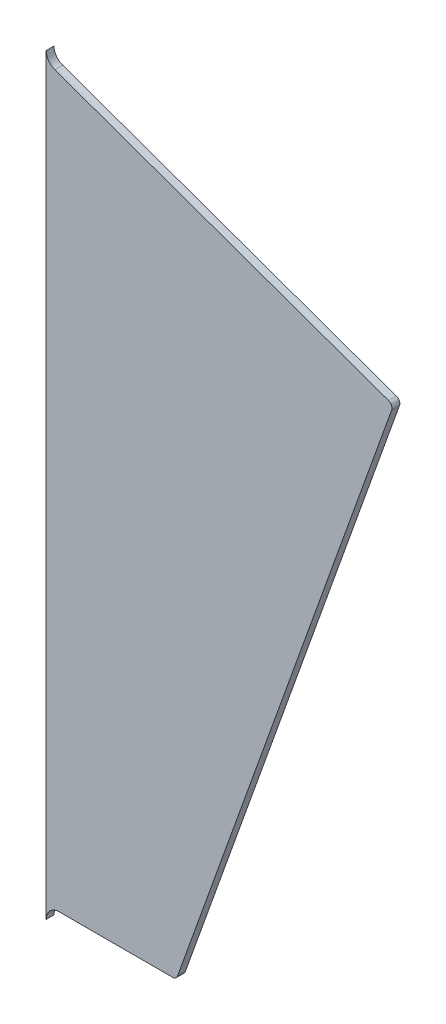
ISO-10303-21;
HEADER;
FILE_DESCRIPTION(('STEP AP214'),'2;1');
FILE_NAME('part.step','',(''),(''),'','','');
FILE_SCHEMA(('AUTOMOTIVE_DESIGN { 1 0 10303 214 1 1 1 1 }'));
ENDSEC;
DATA;
#1=APPLICATION_CONTEXT('core data for automotive mechanical design processes');
#2=APPLICATION_PROTOCOL_DEFINITION('international standard','automotive_design',2000,#1);
#3=PRODUCT_CONTEXT('',#1,'mechanical');
#4=PRODUCT('Part','Part','',(#3));
#5=PRODUCT_RELATED_PRODUCT_CATEGORY('part','',(#4));
#6=PRODUCT_DEFINITION_FORMATION('','',#4);
#7=PRODUCT_DEFINITION_CONTEXT('part definition',#1,'design');
#8=PRODUCT_DEFINITION('design','',#6,#7);
#9=PRODUCT_DEFINITION_SHAPE('','',#8);
#10=(LENGTH_UNIT() NAMED_UNIT(*) SI_UNIT(.MILLI.,.METRE.));
#11=(NAMED_UNIT(*) PLANE_ANGLE_UNIT() SI_UNIT($,.RADIAN.));
#12=(NAMED_UNIT(*) SI_UNIT($,.STERADIAN.) SOLID_ANGLE_UNIT());
#13=UNCERTAINTY_MEASURE_WITH_UNIT(LENGTH_MEASURE(1.E-05),#10,'distance_accuracy_value','');
#14=(GEOMETRIC_REPRESENTATION_CONTEXT(3) GLOBAL_UNCERTAINTY_ASSIGNED_CONTEXT((#13)) GLOBAL_UNIT_ASSIGNED_CONTEXT((#10,
#11,#12)) REPRESENTATION_CONTEXT('',''));
#15=CARTESIAN_POINT('',(0.,0.,0.));
#16=DIRECTION('',(0.,0.,1.));
#17=DIRECTION('',(1.,0.,0.));
#18=AXIS2_PLACEMENT_3D('',#15,#16,#17);
#19=CARTESIAN_POINT('',(3.99999999999998,3.34627629908769,-1.5));
#20=DIRECTION('',(0.,0.,1.));
#21=DIRECTION('',(1.,0.,0.));
#22=AXIS2_PLACEMENT_3D('',#19,#20,#21);
#23=CYLINDRICAL_SURFACE('',#22,2.50000000000001);
#24=CARTESIAN_POINT('',(3.99999999999998,3.34627629908769,0.));
#25=DIRECTION('',(0.,0.,-1.));
#26=DIRECTION('',(1.,0.,0.));
#27=AXIS2_PLACEMENT_3D('',#24,#25,#26);
#28=CIRCLE('',#27,2.50000000000001);
#29=CARTESIAN_POINT('',(3.15619224022895,0.992983188455233,0.));
#30=VERTEX_POINT('',#29);
#31=CARTESIAN_POINT('',(1.49999999999997,3.34627629908769,0.));
#32=VERTEX_POINT('',#31);
#33=EDGE_CURVE('E135',#30,#32,#28,.T.);
#34=ORIENTED_EDGE('',*,*,#33,.F.);
#35=DIRECTION('',(0.,0.,1.));
#36=VECTOR('',#35,1.);
#37=CARTESIAN_POINT('',(3.15619224022895,0.992983188455233,-1.5));
#38=LINE('',#37,#36);
#39=CARTESIAN_POINT('',(3.15619224022895,0.992983188455233,-1.5));
#40=VERTEX_POINT('',#39);
#41=EDGE_CURVE('E11',#40,#30,#38,.T.);
#42=ORIENTED_EDGE('',*,*,#41,.F.);
#43=CARTESIAN_POINT('',(3.99999999999998,3.34627629908769,-1.5));
#44=DIRECTION('',(0.,0.,-1.));
#45=DIRECTION('',(1.,0.,0.));
#46=AXIS2_PLACEMENT_3D('',#43,#44,#45);
#47=CIRCLE('',#46,2.50000000000001);
#48=CARTESIAN_POINT('',(1.49999999999997,3.34627629908769,-1.5));
#49=VERTEX_POINT('',#48);
#50=EDGE_CURVE('E155',#40,#49,#47,.T.);
#51=ORIENTED_EDGE('',*,*,#50,.T.);
#52=DIRECTION('',(0.,0.,1.));
#53=VECTOR('',#52,1.);
#54=CARTESIAN_POINT('',(1.49999999999997,3.34627629908769,-1.5));
#55=LINE('',#54,#53);
#56=EDGE_CURVE('E41',#49,#32,#55,.T.);
#57=ORIENTED_EDGE('',*,*,#56,.T.);
#58=EDGE_LOOP('',(#34,#42,#51,#57));
#59=FACE_BOUND('',#58,.T.);
#60=ADVANCED_FACE('F38',(#59),#23,.F.);
#61=CARTESIAN_POINT('',(67.1520670274041,-21.9536763223277,-1.5));
#62=DIRECTION('',(0.337523103908415,0.941317244252982,0.));
#63=DIRECTION('',(-0.941317244252983,0.337523103908415,0.));
#64=AXIS2_PLACEMENT_3D('',#61,#62,#63);
#65=PLANE('',#64);
#66=DIRECTION('',(-0.941317244252982,0.337523103908415,0.));
#67=VECTOR('',#66,1.);
#68=CARTESIAN_POINT('',(67.1520670274041,-21.9536763223277,0.));
#69=LINE('',#68,#67);
#70=CARTESIAN_POINT('',(67.1520670274041,-21.9536763223277,0.));
#71=VERTEX_POINT('',#70);
#72=EDGE_CURVE('E153',#71,#30,#69,.T.);
#73=ORIENTED_EDGE('',*,*,#72,.F.);
#74=DIRECTION('',(0.,0.,1.));
#75=VECTOR('',#74,1.);
#76=CARTESIAN_POINT('',(67.1520670274041,-21.9536763223277,-1.5));
#77=LINE('',#76,#75);
#78=CARTESIAN_POINT('',(67.1520670274041,-21.9536763223277,-1.5));
#79=VERTEX_POINT('',#78);
#80=EDGE_CURVE('E47',#79,#71,#77,.T.);
#81=ORIENTED_EDGE('',*,*,#80,.F.);
#82=DIRECTION('',(-0.941317244252982,0.337523103908415,0.));
#83=VECTOR('',#82,1.);
#84=CARTESIAN_POINT('',(67.1520670274041,-21.9536763223277,-1.5));
#85=LINE('',#84,#83);
#86=EDGE_CURVE('E125',#79,#40,#85,.T.);
#87=ORIENTED_EDGE('',*,*,#86,.T.);
#88=ORIENTED_EDGE('',*,*,#41,.T.);
#89=EDGE_LOOP('',(#73,#81,#87,#88));
#90=FACE_BOUND('',#89,.T.);
#91=ADVANCED_FACE('F167',(#90),#65,.T.);
#92=CARTESIAN_POINT('',(66.8145439234957,-22.8949935665807,-1.5));
#93=DIRECTION('',(0.,0.,1.));
#94=DIRECTION('',(1.,0.,0.));
#95=AXIS2_PLACEMENT_3D('',#92,#93,#94);
#96=CYLINDRICAL_SURFACE('',#95,1.);
#97=CARTESIAN_POINT('',(66.8145439234957,-22.8949935665807,0.));
#98=DIRECTION('',(0.,0.,1.));
#99=DIRECTION('',(1.,0.,0.));
#100=AXIS2_PLACEMENT_3D('',#97,#98,#99);
#101=CIRCLE('',#100,1.);
#102=CARTESIAN_POINT('',(67.7558611677487,-23.2325166704891,0.));
#103=VERTEX_POINT('',#102);
#104=EDGE_CURVE('E112',#103,#71,#101,.T.);
#105=ORIENTED_EDGE('',*,*,#104,.F.);
#106=DIRECTION('',(0.,0.,1.));
#107=VECTOR('',#106,1.);
#108=CARTESIAN_POINT('',(67.7558611677487,-23.2325166704891,-1.5));
#109=LINE('',#108,#107);
#110=CARTESIAN_POINT('',(67.7558611677487,-23.2325166704891,-1.5));
#111=VERTEX_POINT('',#110);
#112=EDGE_CURVE('E107',#111,#103,#109,.T.);
#113=ORIENTED_EDGE('',*,*,#112,.F.);
#114=CARTESIAN_POINT('',(66.8145439234957,-22.8949935665807,-1.5));
#115=DIRECTION('',(0.,0.,1.));
#116=DIRECTION('',(1.,0.,0.));
#117=AXIS2_PLACEMENT_3D('',#114,#115,#116);
#118=CIRCLE('',#117,1.);
#119=EDGE_CURVE('E110',#111,#79,#118,.T.);
#120=ORIENTED_EDGE('',*,*,#119,.T.);
#121=ORIENTED_EDGE('',*,*,#80,.T.);
#122=EDGE_LOOP('',(#105,#113,#120,#121));
#123=FACE_BOUND('',#122,.T.);
#124=ADVANCED_FACE('F109',(#123),#96,.T.);
#125=CARTESIAN_POINT('',(26.6780247874124,-137.794380121192,-1.5));
#126=DIRECTION('',(0.941317244252983,-0.337523103908415,0.));
#127=DIRECTION('',(0.337523103908415,0.941317244252983,0.));
#128=AXIS2_PLACEMENT_3D('',#125,#126,#127);
#129=PLANE('',#128);
#130=DIRECTION('',(0.337523103908415,0.941317244252983,0.));
#131=VECTOR('',#130,1.);
#132=CARTESIAN_POINT('',(26.6780247874124,-137.794380121192,0.));
#133=LINE('',#132,#131);
#134=CARTESIAN_POINT('',(26.6780247874123,-137.794380121192,0.));
#135=VERTEX_POINT('',#134);
#136=EDGE_CURVE('E150',#135,#103,#133,.T.);
#137=ORIENTED_EDGE('',*,*,#136,.F.);
#138=DIRECTION('',(0.,0.,1.));
#139=VECTOR('',#138,1.);
#140=CARTESIAN_POINT('',(26.6780247874123,-137.794380121192,-1.5));
#141=LINE('',#140,#139);
#142=CARTESIAN_POINT('',(26.6780247874123,-137.794380121192,-1.5));
#143=VERTEX_POINT('',#142);
#144=EDGE_CURVE('E117',#143,#135,#141,.T.);
#145=ORIENTED_EDGE('',*,*,#144,.F.);
#146=DIRECTION('',(0.337523103908415,0.941317244252983,0.));
#147=VECTOR('',#146,1.);
#148=CARTESIAN_POINT('',(26.6780247874124,-137.794380121192,-1.5));
#149=LINE('',#148,#147);
#150=EDGE_CURVE('E123',#143,#111,#149,.T.);
#151=ORIENTED_EDGE('',*,*,#150,.T.);
#152=ORIENTED_EDGE('',*,*,#112,.T.);
#153=EDGE_LOOP('',(#137,#145,#151,#152));
#154=FACE_BOUND('',#153,.T.);
#155=ADVANCED_FACE('F127',(#154),#129,.T.);
#156=CARTESIAN_POINT('',(25.7367075431594,-137.456857017283,-1.5));
#157=DIRECTION('',(0.,0.,1.));
#158=DIRECTION('',(1.,0.,0.));
#159=AXIS2_PLACEMENT_3D('',#156,#157,#158);
#160=CYLINDRICAL_SURFACE('',#159,1.);
#161=CARTESIAN_POINT('',(25.7367075431594,-137.456857017283,0.));
#162=DIRECTION('',(0.,0.,1.));
#163=DIRECTION('',(1.,0.,0.));
#164=AXIS2_PLACEMENT_3D('',#161,#162,#163);
#165=CIRCLE('',#164,1.);
#166=CARTESIAN_POINT('',(25.7367075431593,-138.456857017283,0.));
#167=VERTEX_POINT('',#166);
#168=EDGE_CURVE('E147',#167,#135,#165,.T.);
#169=ORIENTED_EDGE('',*,*,#168,.F.);
#170=DIRECTION('',(0.,0.,1.));
#171=VECTOR('',#170,1.);
#172=CARTESIAN_POINT('',(25.7367075431593,-138.456857017283,-1.5));
#173=LINE('',#172,#171);
#174=CARTESIAN_POINT('',(25.7367075431593,-138.456857017283,-1.5));
#175=VERTEX_POINT('',#174);
#176=EDGE_CURVE('E159',#175,#167,#173,.T.);
#177=ORIENTED_EDGE('',*,*,#176,.F.);
#178=CARTESIAN_POINT('',(25.7367075431594,-137.456857017283,-1.5));
#179=DIRECTION('',(0.,0.,1.));
#180=DIRECTION('',(1.,0.,0.));
#181=AXIS2_PLACEMENT_3D('',#178,#179,#180);
#182=CIRCLE('',#181,1.);
#183=EDGE_CURVE('E128',#175,#143,#182,.T.);
#184=ORIENTED_EDGE('',*,*,#183,.T.);
#185=ORIENTED_EDGE('',*,*,#144,.T.);
#186=EDGE_LOOP('',(#169,#177,#184,#185));
#187=FACE_BOUND('',#186,.T.);
#188=ADVANCED_FACE('F180',(#187),#160,.T.);
#189=CARTESIAN_POINT('',(4.,-138.456857017283,-1.5));
#190=DIRECTION('',(0.,-1.,0.));
#191=DIRECTION('',(0.,0.,-1.));
#192=AXIS2_PLACEMENT_3D('',#189,#190,#191);
#193=PLANE('',#192);
#194=DIRECTION('',(1.,0.,0.));
#195=VECTOR('',#194,1.);
#196=CARTESIAN_POINT('',(4.,-138.456857017283,0.));
#197=LINE('',#196,#195);
#198=CARTESIAN_POINT('',(4.,-138.456857017283,0.));
#199=VERTEX_POINT('',#198);
#200=EDGE_CURVE('E144',#199,#167,#197,.T.);
#201=ORIENTED_EDGE('',*,*,#200,.F.);
#202=DIRECTION('',(0.,0.,1.));
#203=VECTOR('',#202,1.);
#204=CARTESIAN_POINT('',(4.,-138.456857017283,-1.5));
#205=LINE('',#204,#203);
#206=CARTESIAN_POINT('',(4.,-138.456857017283,-1.5));
#207=VERTEX_POINT('',#206);
#208=EDGE_CURVE('E161',#207,#199,#205,.T.);
#209=ORIENTED_EDGE('',*,*,#208,.F.);
#210=DIRECTION('',(1.,0.,0.));
#211=VECTOR('',#210,1.);
#212=CARTESIAN_POINT('',(4.,-138.456857017283,-1.5));
#213=LINE('',#212,#211);
#214=EDGE_CURVE('E130',#207,#175,#213,.T.);
#215=ORIENTED_EDGE('',*,*,#214,.T.);
#216=ORIENTED_EDGE('',*,*,#176,.T.);
#217=EDGE_LOOP('',(#201,#209,#215,#216));
#218=FACE_BOUND('',#217,.T.);
#219=ADVANCED_FACE('F183',(#218),#193,.T.);
#220=CARTESIAN_POINT('',(4.,-140.956857017283,-1.5));
#221=DIRECTION('',(0.,0.,1.));
#222=DIRECTION('',(1.,0.,0.));
#223=AXIS2_PLACEMENT_3D('',#220,#221,#222);
#224=CYLINDRICAL_SURFACE('',#223,2.5);
#225=CARTESIAN_POINT('',(4.,-140.956857017283,0.));
#226=DIRECTION('',(0.,0.,-1.));
#227=DIRECTION('',(1.,0.,0.));
#228=AXIS2_PLACEMENT_3D('',#225,#226,#227);
#229=CIRCLE('',#228,2.5);
#230=CARTESIAN_POINT('',(1.5,-140.956857017283,0.));
#231=VERTEX_POINT('',#230);
#232=EDGE_CURVE('E141',#231,#199,#229,.T.);
#233=ORIENTED_EDGE('',*,*,#232,.F.);
#234=DIRECTION('',(0.,0.,1.));
#235=VECTOR('',#234,1.);
#236=CARTESIAN_POINT('',(1.5,-140.956857017283,-1.5));
#237=LINE('',#236,#235);
#238=CARTESIAN_POINT('',(1.5,-140.956857017283,-1.5));
#239=VERTEX_POINT('',#238);
#240=EDGE_CURVE('E162',#239,#231,#237,.T.);
#241=ORIENTED_EDGE('',*,*,#240,.F.);
#242=CARTESIAN_POINT('',(4.,-140.956857017283,-1.5));
#243=DIRECTION('',(0.,0.,-1.));
#244=DIRECTION('',(1.,0.,0.));
#245=AXIS2_PLACEMENT_3D('',#242,#243,#244);
#246=CIRCLE('',#245,2.5);
#247=EDGE_CURVE('E278',#239,#207,#246,.T.);
#248=ORIENTED_EDGE('',*,*,#247,.T.);
#249=ORIENTED_EDGE('',*,*,#208,.T.);
#250=EDGE_LOOP('',(#233,#241,#248,#249));
#251=FACE_BOUND('',#250,.T.);
#252=ADVANCED_FACE('F187',(#251),#224,.F.);
#253=CARTESIAN_POINT('',(1.5,-140.956857017283,-1.5));
#254=DIRECTION('',(-1.,0.,0.));
#255=DIRECTION('',(0.,-1.,0.));
#256=AXIS2_PLACEMENT_3D('',#253,#254,#255);
#257=PLANE('',#256);
#258=DIRECTION('',(0.,-1.,0.));
#259=VECTOR('',#258,1.);
#260=CARTESIAN_POINT('',(1.5,-140.956857017283,0.));
#261=LINE('',#260,#259);
#262=EDGE_CURVE('E138',#32,#231,#261,.T.);
#263=ORIENTED_EDGE('',*,*,#262,.F.);
#264=ORIENTED_EDGE('',*,*,#56,.F.);
#265=DIRECTION('',(0.,-1.,0.));
#266=VECTOR('',#265,1.);
#267=CARTESIAN_POINT('',(1.5,-140.956857017283,-1.5));
#268=LINE('',#267,#266);
#269=EDGE_CURVE('E279',#49,#239,#268,.T.);
#270=ORIENTED_EDGE('',*,*,#269,.T.);
#271=ORIENTED_EDGE('',*,*,#240,.T.);
#272=EDGE_LOOP('',(#263,#264,#270,#271));
#273=FACE_BOUND('',#272,.T.);
#274=ADVANCED_FACE('F164',(#273),#257,.T.);
#275=CARTESIAN_POINT('',(3.99999999999998,3.34627629908769,-1.5));
#276=DIRECTION('',(0.,0.,1.));
#277=DIRECTION('',(1.,0.,0.));
#278=AXIS2_PLACEMENT_3D('',#275,#276,#277);
#279=PLANE('',#278);
#280=ORIENTED_EDGE('',*,*,#50,.F.);
#281=ORIENTED_EDGE('',*,*,#86,.F.);
#282=ORIENTED_EDGE('',*,*,#119,.F.);
#283=ORIENTED_EDGE('',*,*,#150,.F.);
#284=ORIENTED_EDGE('',*,*,#183,.F.);
#285=ORIENTED_EDGE('',*,*,#214,.F.);
#286=ORIENTED_EDGE('',*,*,#247,.F.);
#287=ORIENTED_EDGE('',*,*,#269,.F.);
#288=EDGE_LOOP('',(#280,#281,#282,#283,#284,#285,#286,#287));
#289=FACE_BOUND('',#288,.T.);
#290=ADVANCED_FACE('F121',(#289),#279,.F.);
#291=CARTESIAN_POINT('',(3.99999999999998,3.34627629908769,0.));
#292=DIRECTION('',(0.,0.,1.));
#293=DIRECTION('',(1.,0.,0.));
#294=AXIS2_PLACEMENT_3D('',#291,#292,#293);
#295=PLANE('',#294);
#296=ORIENTED_EDGE('',*,*,#33,.T.);
#297=ORIENTED_EDGE('',*,*,#262,.T.);
#298=ORIENTED_EDGE('',*,*,#232,.T.);
#299=ORIENTED_EDGE('',*,*,#200,.T.);
#300=ORIENTED_EDGE('',*,*,#168,.T.);
#301=ORIENTED_EDGE('',*,*,#136,.T.);
#302=ORIENTED_EDGE('',*,*,#104,.T.);
#303=ORIENTED_EDGE('',*,*,#72,.T.);
#304=EDGE_LOOP('',(#296,#297,#298,#299,#300,#301,#302,#303));
#305=FACE_BOUND('',#304,.T.);
#306=ADVANCED_FACE('F166',(#305),#295,.T.);
#307=CLOSED_SHELL('',(#60,#91,#124,#155,#188,#219,#252,#274,#290,#306));
#308=MANIFOLD_SOLID_BREP('B2',#307);
#309=ADVANCED_BREP_SHAPE_REPRESENTATION('',(#18,#308),#14);
#310=SHAPE_DEFINITION_REPRESENTATION(#9,#309);
ENDSEC;
END-ISO-10303-21;
